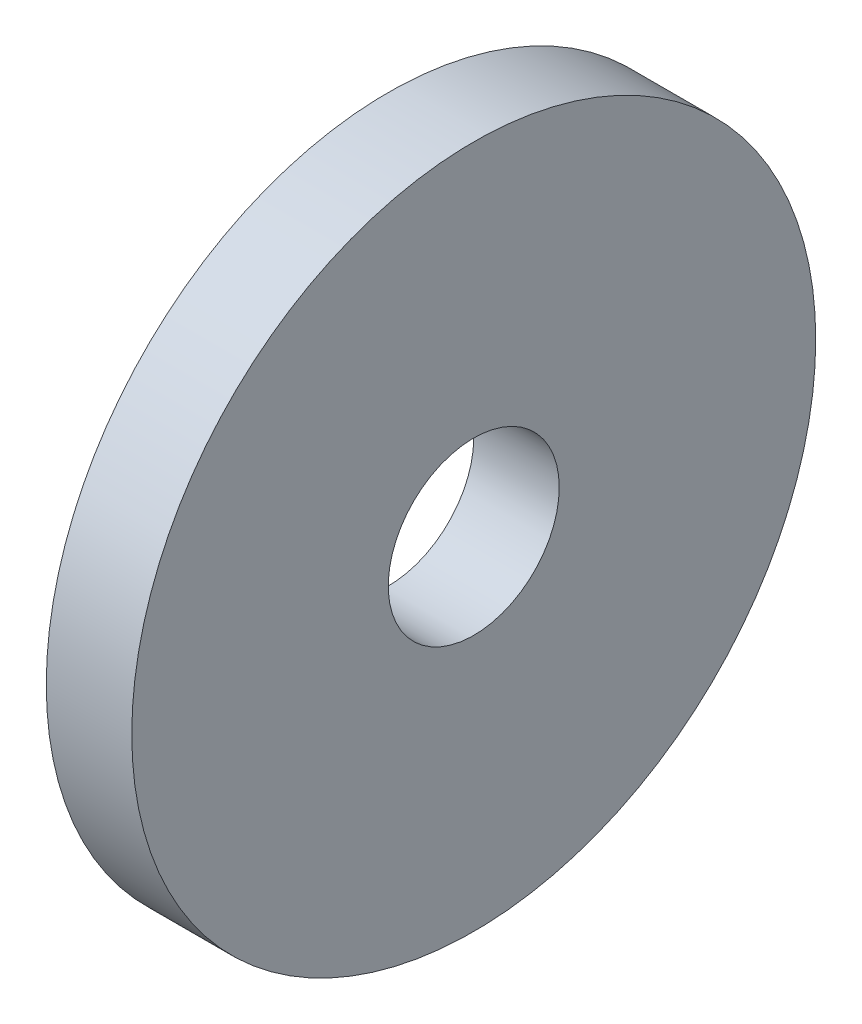
ISO-10303-21;
HEADER;
FILE_DESCRIPTION(('STEP AP214'),'2;1');
FILE_NAME('part.step','',(''),(''),'','','');
FILE_SCHEMA(('AUTOMOTIVE_DESIGN { 1 0 10303 214 1 1 1 1 }'));
ENDSEC;
DATA;
#1=APPLICATION_CONTEXT('core data for automotive mechanical design processes');
#2=APPLICATION_PROTOCOL_DEFINITION('international standard','automotive_design',2000,#1);
#3=PRODUCT_CONTEXT('',#1,'mechanical');
#4=PRODUCT('Part','Part','',(#3));
#5=PRODUCT_RELATED_PRODUCT_CATEGORY('part','',(#4));
#6=PRODUCT_DEFINITION_FORMATION('','',#4);
#7=PRODUCT_DEFINITION_CONTEXT('part definition',#1,'design');
#8=PRODUCT_DEFINITION('design','',#6,#7);
#9=PRODUCT_DEFINITION_SHAPE('','',#8);
#10=(LENGTH_UNIT() NAMED_UNIT(*) SI_UNIT(.MILLI.,.METRE.));
#11=(NAMED_UNIT(*) PLANE_ANGLE_UNIT() SI_UNIT($,.RADIAN.));
#12=(NAMED_UNIT(*) SI_UNIT($,.STERADIAN.) SOLID_ANGLE_UNIT());
#13=UNCERTAINTY_MEASURE_WITH_UNIT(LENGTH_MEASURE(1.E-05),#10,'distance_accuracy_value','');
#14=(GEOMETRIC_REPRESENTATION_CONTEXT(3) GLOBAL_UNCERTAINTY_ASSIGNED_CONTEXT((#13)) GLOBAL_UNIT_ASSIGNED_CONTEXT((#10,
#11,#12)) REPRESENTATION_CONTEXT('',''));
#15=CARTESIAN_POINT('',(0.,0.,0.));
#16=DIRECTION('',(0.,0.,1.));
#17=DIRECTION('',(1.,0.,0.));
#18=AXIS2_PLACEMENT_3D('',#15,#16,#17);
#19=CARTESIAN_POINT('',(3.,0.,0.));
#20=DIRECTION('',(-1.,0.,0.));
#21=DIRECTION('',(0.,0.,1.));
#22=AXIS2_PLACEMENT_3D('',#19,#20,#21);
#23=CYLINDRICAL_SURFACE('',#22,12.);
#24=CARTESIAN_POINT('',(3.,0.,0.));
#25=DIRECTION('',(1.,0.,0.));
#26=DIRECTION('',(0.,0.,-1.));
#27=AXIS2_PLACEMENT_3D('',#24,#25,#26);
#28=CIRCLE('',#27,12.);
#29=CARTESIAN_POINT('',(3.,0.,-12.));
#30=VERTEX_POINT('',#29);
#31=EDGE_CURVE('E10',#30,#30,#28,.T.);
#32=ORIENTED_EDGE('',*,*,#31,.F.);
#33=EDGE_LOOP('',(#32));
#34=FACE_BOUND('',#33,.T.);
#35=CARTESIAN_POINT('',(0.,0.,0.));
#36=DIRECTION('',(1.,0.,0.));
#37=DIRECTION('',(0.,0.,-1.));
#38=AXIS2_PLACEMENT_3D('',#35,#36,#37);
#39=CIRCLE('',#38,12.);
#40=CARTESIAN_POINT('',(0.,0.,-12.));
#41=VERTEX_POINT('',#40);
#42=EDGE_CURVE('E34',#41,#41,#39,.T.);
#43=ORIENTED_EDGE('',*,*,#42,.T.);
#44=EDGE_LOOP('',(#43));
#45=FACE_BOUND('',#44,.T.);
#46=ADVANCED_FACE('F31',(#34,#45),#23,.T.);
#47=CARTESIAN_POINT('',(3.,0.,0.));
#48=DIRECTION('',(1.,0.,0.));
#49=DIRECTION('',(0.,0.,-1.));
#50=AXIS2_PLACEMENT_3D('',#47,#48,#49);
#51=PLANE('',#50);
#52=CARTESIAN_POINT('',(3.,0.,0.));
#53=DIRECTION('',(1.,0.,0.));
#54=DIRECTION('',(0.,0.,-1.));
#55=AXIS2_PLACEMENT_3D('',#52,#53,#54);
#56=CIRCLE('',#55,3.);
#57=CARTESIAN_POINT('',(3.,0.,-3.));
#58=VERTEX_POINT('',#57);
#59=EDGE_CURVE('E41',#58,#58,#56,.T.);
#60=ORIENTED_EDGE('',*,*,#59,.F.);
#61=EDGE_LOOP('',(#60));
#62=FACE_BOUND('',#61,.T.);
#63=ORIENTED_EDGE('',*,*,#31,.T.);
#64=EDGE_LOOP('',(#63));
#65=FACE_BOUND('',#64,.T.);
#66=ADVANCED_FACE('F59',(#62,#65),#51,.T.);
#67=CARTESIAN_POINT('',(0.,0.,0.));
#68=DIRECTION('',(1.,0.,0.));
#69=DIRECTION('',(0.,0.,-1.));
#70=AXIS2_PLACEMENT_3D('',#67,#68,#69);
#71=PLANE('',#70);
#72=CARTESIAN_POINT('',(0.,0.,0.));
#73=DIRECTION('',(1.,0.,0.));
#74=DIRECTION('',(0.,0.,-1.));
#75=AXIS2_PLACEMENT_3D('',#72,#73,#74);
#76=CIRCLE('',#75,3.);
#77=CARTESIAN_POINT('',(0.,0.,-3.));
#78=VERTEX_POINT('',#77);
#79=EDGE_CURVE('E45',#78,#78,#76,.T.);
#80=ORIENTED_EDGE('',*,*,#79,.T.);
#81=EDGE_LOOP('',(#80));
#82=FACE_BOUND('',#81,.T.);
#83=ORIENTED_EDGE('',*,*,#42,.F.);
#84=EDGE_LOOP('',(#83));
#85=FACE_BOUND('',#84,.T.);
#86=ADVANCED_FACE('F49',(#82,#85),#71,.F.);
#87=CARTESIAN_POINT('',(0.,0.,0.));
#88=DIRECTION('',(1.,0.,0.));
#89=DIRECTION('',(0.,0.,-1.));
#90=AXIS2_PLACEMENT_3D('',#87,#88,#89);
#91=CYLINDRICAL_SURFACE('',#90,3.);
#92=ORIENTED_EDGE('',*,*,#59,.T.);
#93=EDGE_LOOP('',(#92));
#94=FACE_BOUND('',#93,.T.);
#95=ORIENTED_EDGE('',*,*,#79,.F.);
#96=EDGE_LOOP('',(#95));
#97=FACE_BOUND('',#96,.T.);
#98=ADVANCED_FACE('F52',(#94,#97),#91,.F.);
#99=CLOSED_SHELL('',(#46,#66,#86,#98));
#100=MANIFOLD_SOLID_BREP('B2',#99);
#101=ADVANCED_BREP_SHAPE_REPRESENTATION('',(#18,#100),#14);
#102=SHAPE_DEFINITION_REPRESENTATION(#9,#101);
ENDSEC;
END-ISO-10303-21;
